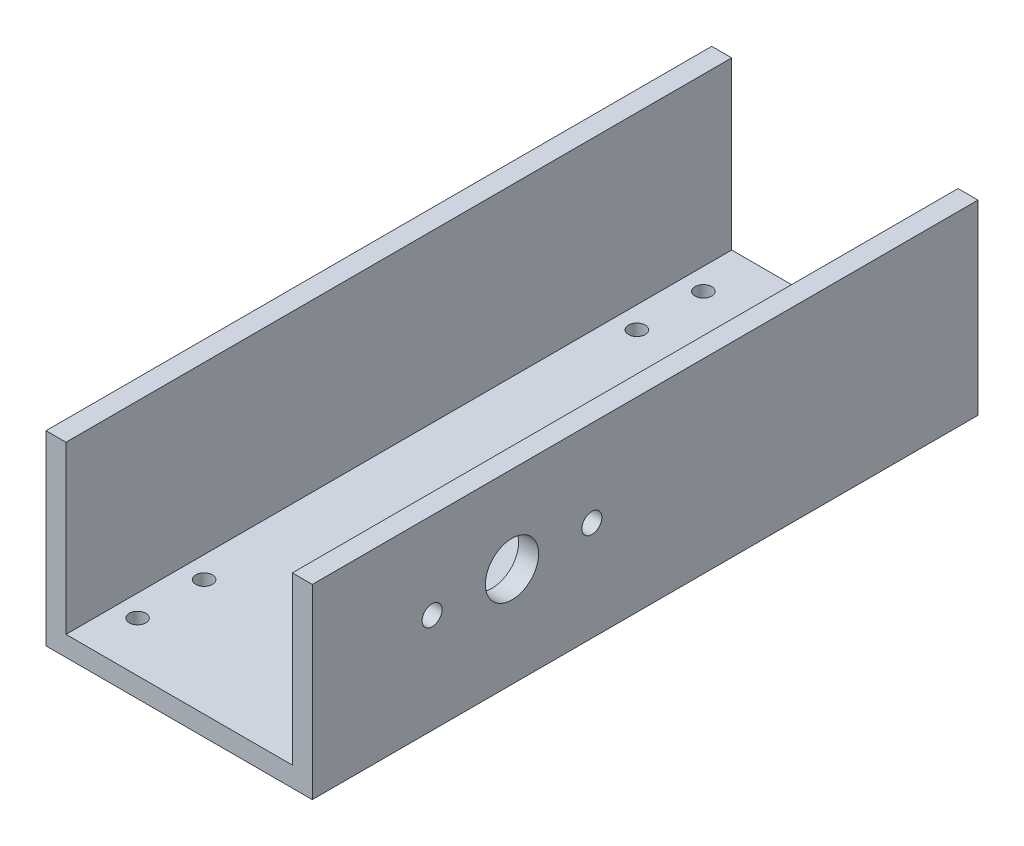
ISO-10303-21;
HEADER;
FILE_DESCRIPTION(('STEP AP214'),'2;1');
FILE_NAME('part.step','',(''),(''),'','','');
FILE_SCHEMA(('AUTOMOTIVE_DESIGN { 1 0 10303 214 1 1 1 1 }'));
ENDSEC;
DATA;
#1=APPLICATION_CONTEXT('core data for automotive mechanical design processes');
#2=APPLICATION_PROTOCOL_DEFINITION('international standard','automotive_design',2000,#1);
#3=PRODUCT_CONTEXT('',#1,'mechanical');
#4=PRODUCT('Part','Part','',(#3));
#5=PRODUCT_RELATED_PRODUCT_CATEGORY('part','',(#4));
#6=PRODUCT_DEFINITION_FORMATION('','',#4);
#7=PRODUCT_DEFINITION_CONTEXT('part definition',#1,'design');
#8=PRODUCT_DEFINITION('design','',#6,#7);
#9=PRODUCT_DEFINITION_SHAPE('','',#8);
#10=(LENGTH_UNIT() NAMED_UNIT(*) SI_UNIT(.MILLI.,.METRE.));
#11=(NAMED_UNIT(*) PLANE_ANGLE_UNIT() SI_UNIT($,.RADIAN.));
#12=(NAMED_UNIT(*) SI_UNIT($,.STERADIAN.) SOLID_ANGLE_UNIT());
#13=UNCERTAINTY_MEASURE_WITH_UNIT(LENGTH_MEASURE(1.E-05),#10,'distance_accuracy_value','');
#14=(GEOMETRIC_REPRESENTATION_CONTEXT(3) GLOBAL_UNCERTAINTY_ASSIGNED_CONTEXT((#13)) GLOBAL_UNIT_ASSIGNED_CONTEXT((#10,
#11,#12)) REPRESENTATION_CONTEXT('',''));
#15=CARTESIAN_POINT('',(0.,0.,0.));
#16=DIRECTION('',(0.,0.,1.));
#17=DIRECTION('',(1.,0.,0.));
#18=AXIS2_PLACEMENT_3D('',#15,#16,#17);
#19=CARTESIAN_POINT('',(34.,56.,200.));
#20=DIRECTION('',(1.,0.,0.));
#21=DIRECTION('',(0.,1.,0.));
#22=AXIS2_PLACEMENT_3D('',#19,#20,#21);
#23=PLANE('',#22);
#24=DIRECTION('',(0.,-1.,0.));
#25=VECTOR('',#24,1.);
#26=CARTESIAN_POINT('',(34.,56.,0.));
#27=LINE('',#26,#25);
#28=CARTESIAN_POINT('',(34.,56.,0.));
#29=VERTEX_POINT('',#28);
#30=CARTESIAN_POINT('',(34.,5.99999999999999,0.));
#31=VERTEX_POINT('',#30);
#32=EDGE_CURVE('E135',#29,#31,#27,.T.);
#33=ORIENTED_EDGE('',*,*,#32,.T.);
#34=DIRECTION('',(0.,0.,-1.));
#35=VECTOR('',#34,1.);
#36=CARTESIAN_POINT('',(34.,5.99999999999999,200.));
#37=LINE('',#36,#35);
#38=CARTESIAN_POINT('',(34.,5.99999999999999,200.));
#39=VERTEX_POINT('',#38);
#40=EDGE_CURVE('E44',#39,#31,#37,.T.);
#41=ORIENTED_EDGE('',*,*,#40,.F.);
#42=DIRECTION('',(0.,-1.,0.));
#43=VECTOR('',#42,1.);
#44=CARTESIAN_POINT('',(34.,56.,200.));
#45=LINE('',#44,#43);
#46=CARTESIAN_POINT('',(34.,56.,200.));
#47=VERTEX_POINT('',#46);
#48=EDGE_CURVE('E95',#47,#39,#45,.T.);
#49=ORIENTED_EDGE('',*,*,#48,.F.);
#50=DIRECTION('',(0.,0.,-1.));
#51=VECTOR('',#50,1.);
#52=CARTESIAN_POINT('',(34.,56.,200.));
#53=LINE('',#52,#51);
#54=EDGE_CURVE('E11',#47,#29,#53,.T.);
#55=ORIENTED_EDGE('',*,*,#54,.T.);
#56=EDGE_LOOP('',(#33,#41,#49,#55));
#57=FACE_BOUND('',#56,.T.);
#58=CARTESIAN_POINT('',(34.,30.,140.));
#59=DIRECTION('',(1.,0.,0.));
#60=DIRECTION('',(0.,1.,0.));
#61=AXIS2_PLACEMENT_3D('',#58,#59,#60);
#62=CIRCLE('',#61,8.00000000000001);
#63=CARTESIAN_POINT('',(34.,38.,140.));
#64=VERTEX_POINT('',#63);
#65=EDGE_CURVE('E136',#64,#64,#62,.F.);
#66=ORIENTED_EDGE('',*,*,#65,.F.);
#67=EDGE_LOOP('',(#66));
#68=FACE_BOUND('',#67,.T.);
#69=CARTESIAN_POINT('',(34.,30.,164.));
#70=DIRECTION('',(1.,0.,0.));
#71=DIRECTION('',(0.,1.,0.));
#72=AXIS2_PLACEMENT_3D('',#69,#70,#71);
#73=CIRCLE('',#72,2.99999999999999);
#74=CARTESIAN_POINT('',(34.,33.,164.));
#75=VERTEX_POINT('',#74);
#76=EDGE_CURVE('E183',#75,#75,#73,.F.);
#77=ORIENTED_EDGE('',*,*,#76,.F.);
#78=EDGE_LOOP('',(#77));
#79=FACE_BOUND('',#78,.T.);
#80=CARTESIAN_POINT('',(34.,30.,116.));
#81=DIRECTION('',(1.,0.,0.));
#82=DIRECTION('',(0.,1.,0.));
#83=AXIS2_PLACEMENT_3D('',#80,#81,#82);
#84=CIRCLE('',#83,3.00000000000001);
#85=CARTESIAN_POINT('',(34.,33.,116.));
#86=VERTEX_POINT('',#85);
#87=EDGE_CURVE('E189',#86,#86,#84,.T.);
#88=ORIENTED_EDGE('',*,*,#87,.T.);
#89=EDGE_LOOP('',(#88));
#90=FACE_BOUND('',#89,.T.);
#91=ADVANCED_FACE('F35',(#57,#68,#79,#90),#23,.F.);
#92=CARTESIAN_POINT('',(40.,0.,200.));
#93=DIRECTION('',(-1.,0.,0.));
#94=DIRECTION('',(0.,0.,1.));
#95=AXIS2_PLACEMENT_3D('',#92,#93,#94);
#96=PLANE('',#95);
#97=DIRECTION('',(0.,1.,0.));
#98=VECTOR('',#97,1.);
#99=CARTESIAN_POINT('',(40.,0.,0.));
#100=LINE('',#99,#98);
#101=CARTESIAN_POINT('',(40.,0.,0.));
#102=VERTEX_POINT('',#101);
#103=CARTESIAN_POINT('',(40.,56.,0.));
#104=VERTEX_POINT('',#103);
#105=EDGE_CURVE('E87',#102,#104,#100,.T.);
#106=ORIENTED_EDGE('',*,*,#105,.T.);
#107=DIRECTION('',(0.,0.,-1.));
#108=VECTOR('',#107,1.);
#109=CARTESIAN_POINT('',(40.,56.,200.));
#110=LINE('',#109,#108);
#111=CARTESIAN_POINT('',(40.,56.,200.));
#112=VERTEX_POINT('',#111);
#113=EDGE_CURVE('E128',#112,#104,#110,.T.);
#114=ORIENTED_EDGE('',*,*,#113,.F.);
#115=DIRECTION('',(0.,1.,0.));
#116=VECTOR('',#115,1.);
#117=CARTESIAN_POINT('',(40.,0.,200.));
#118=LINE('',#117,#116);
#119=CARTESIAN_POINT('',(40.,0.,200.));
#120=VERTEX_POINT('',#119);
#121=EDGE_CURVE('E52',#120,#112,#118,.T.);
#122=ORIENTED_EDGE('',*,*,#121,.F.);
#123=DIRECTION('',(0.,0.,-1.));
#124=VECTOR('',#123,1.);
#125=CARTESIAN_POINT('',(40.,0.,200.));
#126=LINE('',#125,#124);
#127=EDGE_CURVE('E124',#120,#102,#126,.T.);
#128=ORIENTED_EDGE('',*,*,#127,.T.);
#129=EDGE_LOOP('',(#106,#114,#122,#128));
#130=FACE_BOUND('',#129,.T.);
#131=CARTESIAN_POINT('',(40.,30.,140.));
#132=DIRECTION('',(1.,0.,0.));
#133=DIRECTION('',(0.,0.,-1.));
#134=AXIS2_PLACEMENT_3D('',#131,#132,#133);
#135=CIRCLE('',#134,8.00000000000001);
#136=CARTESIAN_POINT('',(40.,30.,132.));
#137=VERTEX_POINT('',#136);
#138=EDGE_CURVE('E180',#137,#137,#135,.T.);
#139=ORIENTED_EDGE('',*,*,#138,.F.);
#140=EDGE_LOOP('',(#139));
#141=FACE_BOUND('',#140,.T.);
#142=CARTESIAN_POINT('',(40.,30.,164.));
#143=DIRECTION('',(1.,0.,0.));
#144=DIRECTION('',(0.,0.,-1.));
#145=AXIS2_PLACEMENT_3D('',#142,#143,#144);
#146=CIRCLE('',#145,2.99999999999999);
#147=CARTESIAN_POINT('',(40.,30.,161.));
#148=VERTEX_POINT('',#147);
#149=EDGE_CURVE('E186',#148,#148,#146,.T.);
#150=ORIENTED_EDGE('',*,*,#149,.F.);
#151=EDGE_LOOP('',(#150));
#152=FACE_BOUND('',#151,.T.);
#153=CARTESIAN_POINT('',(40.,30.,116.));
#154=DIRECTION('',(1.,0.,0.));
#155=DIRECTION('',(0.,0.,-1.));
#156=AXIS2_PLACEMENT_3D('',#153,#154,#155);
#157=CIRCLE('',#156,3.00000000000001);
#158=CARTESIAN_POINT('',(40.,30.,113.));
#159=VERTEX_POINT('',#158);
#160=EDGE_CURVE('E192',#159,#159,#157,.F.);
#161=ORIENTED_EDGE('',*,*,#160,.T.);
#162=EDGE_LOOP('',(#161));
#163=FACE_BOUND('',#162,.T.);
#164=ADVANCED_FACE('F282',(#130,#141,#152,#163),#96,.F.);
#165=CARTESIAN_POINT('',(40.,56.,200.));
#166=DIRECTION('',(0.,-1.,0.));
#167=DIRECTION('',(0.,0.,-1.));
#168=AXIS2_PLACEMENT_3D('',#165,#166,#167);
#169=PLANE('',#168);
#170=DIRECTION('',(-1.,0.,0.));
#171=VECTOR('',#170,1.);
#172=CARTESIAN_POINT('',(40.,56.,0.));
#173=LINE('',#172,#171);
#174=EDGE_CURVE('E132',#104,#29,#173,.T.);
#175=ORIENTED_EDGE('',*,*,#174,.T.);
#176=ORIENTED_EDGE('',*,*,#54,.F.);
#177=DIRECTION('',(-1.,0.,0.));
#178=VECTOR('',#177,1.);
#179=CARTESIAN_POINT('',(40.,56.,200.));
#180=LINE('',#179,#178);
#181=EDGE_CURVE('E147',#112,#47,#180,.T.);
#182=ORIENTED_EDGE('',*,*,#181,.F.);
#183=ORIENTED_EDGE('',*,*,#113,.T.);
#184=EDGE_LOOP('',(#175,#176,#182,#183));
#185=FACE_BOUND('',#184,.T.);
#186=ADVANCED_FACE('F37',(#185),#169,.F.);
#187=CARTESIAN_POINT('',(34.,5.99999999999999,200.));
#188=DIRECTION('',(0.,-1.,0.));
#189=DIRECTION('',(0.,0.,-1.));
#190=AXIS2_PLACEMENT_3D('',#187,#188,#189);
#191=PLANE('',#190);
#192=CARTESIAN_POINT('',(-27.5,5.99999999999999,15.));
#193=DIRECTION('',(0.,-1.,0.));
#194=DIRECTION('',(0.,0.,-1.));
#195=AXIS2_PLACEMENT_3D('',#192,#193,#194);
#196=CIRCLE('',#195,2.49999999999999);
#197=CARTESIAN_POINT('',(-27.5,5.99999999999999,12.5));
#198=VERTEX_POINT('',#197);
#199=EDGE_CURVE('E239',#198,#198,#196,.F.);
#200=ORIENTED_EDGE('',*,*,#199,.F.);
#201=EDGE_LOOP('',(#200));
#202=FACE_BOUND('',#201,.T.);
#203=CARTESIAN_POINT('',(27.5,5.99999999999999,15.));
#204=DIRECTION('',(0.,-1.,0.));
#205=DIRECTION('',(0.,0.,-1.));
#206=AXIS2_PLACEMENT_3D('',#203,#204,#205);
#207=CIRCLE('',#206,2.49999999999999);
#208=CARTESIAN_POINT('',(27.5,5.99999999999999,12.5));
#209=VERTEX_POINT('',#208);
#210=EDGE_CURVE('E233',#209,#209,#207,.F.);
#211=ORIENTED_EDGE('',*,*,#210,.F.);
#212=EDGE_LOOP('',(#211));
#213=FACE_BOUND('',#212,.T.);
#214=CARTESIAN_POINT('',(-27.5,5.99999999999999,35.));
#215=DIRECTION('',(0.,-1.,0.));
#216=DIRECTION('',(0.,0.,-1.));
#217=AXIS2_PLACEMENT_3D('',#214,#215,#216);
#218=CIRCLE('',#217,2.50000000000001);
#219=CARTESIAN_POINT('',(-27.5,5.99999999999999,32.5));
#220=VERTEX_POINT('',#219);
#221=EDGE_CURVE('E227',#220,#220,#218,.F.);
#222=ORIENTED_EDGE('',*,*,#221,.F.);
#223=EDGE_LOOP('',(#222));
#224=FACE_BOUND('',#223,.T.);
#225=CARTESIAN_POINT('',(27.5,5.99999999999999,35.));
#226=DIRECTION('',(0.,-1.,0.));
#227=DIRECTION('',(0.,0.,-1.));
#228=AXIS2_PLACEMENT_3D('',#225,#226,#227);
#229=CIRCLE('',#228,2.50000000000001);
#230=CARTESIAN_POINT('',(27.5,5.99999999999999,32.5));
#231=VERTEX_POINT('',#230);
#232=EDGE_CURVE('E221',#231,#231,#229,.F.);
#233=ORIENTED_EDGE('',*,*,#232,.F.);
#234=EDGE_LOOP('',(#233));
#235=FACE_BOUND('',#234,.T.);
#236=CARTESIAN_POINT('',(27.5,5.99999999999999,165.));
#237=DIRECTION('',(0.,-1.,0.));
#238=DIRECTION('',(0.,0.,-1.));
#239=AXIS2_PLACEMENT_3D('',#236,#237,#238);
#240=CIRCLE('',#239,2.50000000000001);
#241=CARTESIAN_POINT('',(27.5,5.99999999999999,162.5));
#242=VERTEX_POINT('',#241);
#243=EDGE_CURVE('E215',#242,#242,#240,.F.);
#244=ORIENTED_EDGE('',*,*,#243,.F.);
#245=EDGE_LOOP('',(#244));
#246=FACE_BOUND('',#245,.T.);
#247=CARTESIAN_POINT('',(-27.5,5.99999999999999,165.));
#248=DIRECTION('',(0.,-1.,0.));
#249=DIRECTION('',(0.,0.,-1.));
#250=AXIS2_PLACEMENT_3D('',#247,#248,#249);
#251=CIRCLE('',#250,2.50000000000001);
#252=CARTESIAN_POINT('',(-27.5,5.99999999999999,162.5));
#253=VERTEX_POINT('',#252);
#254=EDGE_CURVE('E209',#253,#253,#251,.F.);
#255=ORIENTED_EDGE('',*,*,#254,.F.);
#256=EDGE_LOOP('',(#255));
#257=FACE_BOUND('',#256,.T.);
#258=CARTESIAN_POINT('',(27.5,5.99999999999999,185.));
#259=DIRECTION('',(0.,-1.,0.));
#260=DIRECTION('',(0.,0.,-1.));
#261=AXIS2_PLACEMENT_3D('',#258,#259,#260);
#262=CIRCLE('',#261,2.5);
#263=CARTESIAN_POINT('',(27.5,5.99999999999999,182.5));
#264=VERTEX_POINT('',#263);
#265=EDGE_CURVE('E203',#264,#264,#262,.F.);
#266=ORIENTED_EDGE('',*,*,#265,.F.);
#267=EDGE_LOOP('',(#266));
#268=FACE_BOUND('',#267,.T.);
#269=CARTESIAN_POINT('',(-27.5,5.99999999999999,185.));
#270=DIRECTION('',(0.,-1.,0.));
#271=DIRECTION('',(0.,0.,-1.));
#272=AXIS2_PLACEMENT_3D('',#269,#270,#271);
#273=CIRCLE('',#272,2.5);
#274=CARTESIAN_POINT('',(-27.5,5.99999999999999,182.5));
#275=VERTEX_POINT('',#274);
#276=EDGE_CURVE('E195',#275,#275,#273,.F.);
#277=ORIENTED_EDGE('',*,*,#276,.F.);
#278=EDGE_LOOP('',(#277));
#279=FACE_BOUND('',#278,.T.);
#280=DIRECTION('',(-1.,0.,0.));
#281=VECTOR('',#280,1.);
#282=CARTESIAN_POINT('',(34.,5.99999999999999,0.));
#283=LINE('',#282,#281);
#284=CARTESIAN_POINT('',(-34.,5.99999999999999,0.));
#285=VERTEX_POINT('',#284);
#286=EDGE_CURVE('E138',#31,#285,#283,.T.);
#287=ORIENTED_EDGE('',*,*,#286,.T.);
#288=DIRECTION('',(0.,0.,-1.));
#289=VECTOR('',#288,1.);
#290=CARTESIAN_POINT('',(-34.,5.99999999999999,200.));
#291=LINE('',#290,#289);
#292=CARTESIAN_POINT('',(-34.,5.99999999999999,200.));
#293=VERTEX_POINT('',#292);
#294=EDGE_CURVE('E154',#293,#285,#291,.T.);
#295=ORIENTED_EDGE('',*,*,#294,.F.);
#296=DIRECTION('',(-1.,0.,0.));
#297=VECTOR('',#296,1.);
#298=CARTESIAN_POINT('',(34.,5.99999999999999,200.));
#299=LINE('',#298,#297);
#300=EDGE_CURVE('E162',#39,#293,#299,.T.);
#301=ORIENTED_EDGE('',*,*,#300,.F.);
#302=ORIENTED_EDGE('',*,*,#40,.T.);
#303=EDGE_LOOP('',(#287,#295,#301,#302));
#304=FACE_BOUND('',#303,.T.);
#305=ADVANCED_FACE('F160',(#202,#213,#224,#235,#246,#257,#268,#279,#304),#191,.F.);
#306=CARTESIAN_POINT('',(-34.,56.,200.));
#307=DIRECTION('',(-1.,0.,0.));
#308=DIRECTION('',(0.,-1.,0.));
#309=AXIS2_PLACEMENT_3D('',#306,#307,#308);
#310=PLANE('',#309);
#311=DIRECTION('',(0.,1.,0.));
#312=VECTOR('',#311,1.);
#313=CARTESIAN_POINT('',(-34.,56.,0.));
#314=LINE('',#313,#312);
#315=CARTESIAN_POINT('',(-34.,56.,0.));
#316=VERTEX_POINT('',#315);
#317=EDGE_CURVE('E140',#285,#316,#314,.T.);
#318=ORIENTED_EDGE('',*,*,#317,.T.);
#319=DIRECTION('',(0.,0.,-1.));
#320=VECTOR('',#319,1.);
#321=CARTESIAN_POINT('',(-34.,56.,200.));
#322=LINE('',#321,#320);
#323=CARTESIAN_POINT('',(-34.,56.,200.));
#324=VERTEX_POINT('',#323);
#325=EDGE_CURVE('E151',#324,#316,#322,.T.);
#326=ORIENTED_EDGE('',*,*,#325,.F.);
#327=DIRECTION('',(0.,1.,0.));
#328=VECTOR('',#327,1.);
#329=CARTESIAN_POINT('',(-34.,56.,200.));
#330=LINE('',#329,#328);
#331=EDGE_CURVE('E174',#293,#324,#330,.T.);
#332=ORIENTED_EDGE('',*,*,#331,.F.);
#333=ORIENTED_EDGE('',*,*,#294,.T.);
#334=EDGE_LOOP('',(#318,#326,#332,#333));
#335=FACE_BOUND('',#334,.T.);
#336=ADVANCED_FACE('F170',(#335),#310,.F.);
#337=CARTESIAN_POINT('',(-40.,56.,200.));
#338=DIRECTION('',(0.,-1.,0.));
#339=DIRECTION('',(0.,0.,-1.));
#340=AXIS2_PLACEMENT_3D('',#337,#338,#339);
#341=PLANE('',#340);
#342=DIRECTION('',(-1.,0.,0.));
#343=VECTOR('',#342,1.);
#344=CARTESIAN_POINT('',(-40.,56.,0.));
#345=LINE('',#344,#343);
#346=CARTESIAN_POINT('',(-40.,56.,0.));
#347=VERTEX_POINT('',#346);
#348=EDGE_CURVE('E142',#316,#347,#345,.T.);
#349=ORIENTED_EDGE('',*,*,#348,.T.);
#350=DIRECTION('',(0.,0.,-1.));
#351=VECTOR('',#350,1.);
#352=CARTESIAN_POINT('',(-40.,56.,200.));
#353=LINE('',#352,#351);
#354=CARTESIAN_POINT('',(-40.,56.,200.));
#355=VERTEX_POINT('',#354);
#356=EDGE_CURVE('E123',#355,#347,#353,.T.);
#357=ORIENTED_EDGE('',*,*,#356,.F.);
#358=DIRECTION('',(-1.,0.,0.));
#359=VECTOR('',#358,1.);
#360=CARTESIAN_POINT('',(-40.,56.,200.));
#361=LINE('',#360,#359);
#362=EDGE_CURVE('E114',#324,#355,#361,.T.);
#363=ORIENTED_EDGE('',*,*,#362,.F.);
#364=ORIENTED_EDGE('',*,*,#325,.T.);
#365=EDGE_LOOP('',(#349,#357,#363,#364));
#366=FACE_BOUND('',#365,.T.);
#367=ADVANCED_FACE('F173',(#366),#341,.F.);
#368=CARTESIAN_POINT('',(-40.,0.,200.));
#369=DIRECTION('',(1.,0.,0.));
#370=DIRECTION('',(0.,0.,-1.));
#371=AXIS2_PLACEMENT_3D('',#368,#369,#370);
#372=PLANE('',#371);
#373=DIRECTION('',(0.,-1.,0.));
#374=VECTOR('',#373,1.);
#375=CARTESIAN_POINT('',(-40.,0.,0.));
#376=LINE('',#375,#374);
#377=CARTESIAN_POINT('',(-40.,0.,0.));
#378=VERTEX_POINT('',#377);
#379=EDGE_CURVE('E122',#347,#378,#376,.T.);
#380=ORIENTED_EDGE('',*,*,#379,.T.);
#381=DIRECTION('',(0.,0.,-1.));
#382=VECTOR('',#381,1.);
#383=CARTESIAN_POINT('',(-40.,0.,200.));
#384=LINE('',#383,#382);
#385=CARTESIAN_POINT('',(-40.,0.,200.));
#386=VERTEX_POINT('',#385);
#387=EDGE_CURVE('E119',#386,#378,#384,.T.);
#388=ORIENTED_EDGE('',*,*,#387,.F.);
#389=DIRECTION('',(0.,-1.,0.));
#390=VECTOR('',#389,1.);
#391=CARTESIAN_POINT('',(-40.,0.,200.));
#392=LINE('',#391,#390);
#393=EDGE_CURVE('E108',#355,#386,#392,.T.);
#394=ORIENTED_EDGE('',*,*,#393,.F.);
#395=ORIENTED_EDGE('',*,*,#356,.T.);
#396=EDGE_LOOP('',(#380,#388,#394,#395));
#397=FACE_BOUND('',#396,.T.);
#398=ADVANCED_FACE('F120',(#397),#372,.F.);
#399=CARTESIAN_POINT('',(-40.,0.,200.));
#400=DIRECTION('',(0.,1.,0.));
#401=DIRECTION('',(0.,0.,1.));
#402=AXIS2_PLACEMENT_3D('',#399,#400,#401);
#403=PLANE('',#402);
#404=CARTESIAN_POINT('',(-27.5,0.,15.));
#405=DIRECTION('',(0.,-1.,0.));
#406=DIRECTION('',(0.,0.,1.));
#407=AXIS2_PLACEMENT_3D('',#404,#405,#406);
#408=CIRCLE('',#407,2.49999999999999);
#409=CARTESIAN_POINT('',(-27.5,0.,17.5));
#410=VERTEX_POINT('',#409);
#411=EDGE_CURVE('E242',#410,#410,#408,.T.);
#412=ORIENTED_EDGE('',*,*,#411,.F.);
#413=EDGE_LOOP('',(#412));
#414=FACE_BOUND('',#413,.T.);
#415=CARTESIAN_POINT('',(27.5,0.,15.));
#416=DIRECTION('',(0.,-1.,0.));
#417=DIRECTION('',(0.,0.,1.));
#418=AXIS2_PLACEMENT_3D('',#415,#416,#417);
#419=CIRCLE('',#418,2.49999999999999);
#420=CARTESIAN_POINT('',(27.5,0.,17.5));
#421=VERTEX_POINT('',#420);
#422=EDGE_CURVE('E236',#421,#421,#419,.T.);
#423=ORIENTED_EDGE('',*,*,#422,.F.);
#424=EDGE_LOOP('',(#423));
#425=FACE_BOUND('',#424,.T.);
#426=CARTESIAN_POINT('',(-27.5,0.,35.));
#427=DIRECTION('',(0.,-1.,0.));
#428=DIRECTION('',(0.,0.,1.));
#429=AXIS2_PLACEMENT_3D('',#426,#427,#428);
#430=CIRCLE('',#429,2.50000000000001);
#431=CARTESIAN_POINT('',(-27.5,0.,37.5));
#432=VERTEX_POINT('',#431);
#433=EDGE_CURVE('E230',#432,#432,#430,.T.);
#434=ORIENTED_EDGE('',*,*,#433,.F.);
#435=EDGE_LOOP('',(#434));
#436=FACE_BOUND('',#435,.T.);
#437=CARTESIAN_POINT('',(27.5,0.,35.));
#438=DIRECTION('',(0.,-1.,0.));
#439=DIRECTION('',(0.,0.,1.));
#440=AXIS2_PLACEMENT_3D('',#437,#438,#439);
#441=CIRCLE('',#440,2.50000000000001);
#442=CARTESIAN_POINT('',(27.5,0.,37.5));
#443=VERTEX_POINT('',#442);
#444=EDGE_CURVE('E224',#443,#443,#441,.T.);
#445=ORIENTED_EDGE('',*,*,#444,.F.);
#446=EDGE_LOOP('',(#445));
#447=FACE_BOUND('',#446,.T.);
#448=CARTESIAN_POINT('',(27.5,0.,165.));
#449=DIRECTION('',(0.,-1.,0.));
#450=DIRECTION('',(0.,0.,-1.));
#451=AXIS2_PLACEMENT_3D('',#448,#449,#450);
#452=CIRCLE('',#451,2.50000000000001);
#453=CARTESIAN_POINT('',(27.5,0.,162.5));
#454=VERTEX_POINT('',#453);
#455=EDGE_CURVE('E218',#454,#454,#452,.T.);
#456=ORIENTED_EDGE('',*,*,#455,.F.);
#457=EDGE_LOOP('',(#456));
#458=FACE_BOUND('',#457,.T.);
#459=CARTESIAN_POINT('',(-27.5,0.,165.));
#460=DIRECTION('',(0.,-1.,0.));
#461=DIRECTION('',(0.,0.,-1.));
#462=AXIS2_PLACEMENT_3D('',#459,#460,#461);
#463=CIRCLE('',#462,2.50000000000001);
#464=CARTESIAN_POINT('',(-27.5,0.,162.5));
#465=VERTEX_POINT('',#464);
#466=EDGE_CURVE('E212',#465,#465,#463,.T.);
#467=ORIENTED_EDGE('',*,*,#466,.F.);
#468=EDGE_LOOP('',(#467));
#469=FACE_BOUND('',#468,.T.);
#470=CARTESIAN_POINT('',(27.5,0.,185.));
#471=DIRECTION('',(0.,-1.,0.));
#472=DIRECTION('',(0.,0.,-1.));
#473=AXIS2_PLACEMENT_3D('',#470,#471,#472);
#474=CIRCLE('',#473,2.5);
#475=CARTESIAN_POINT('',(27.5,0.,182.5));
#476=VERTEX_POINT('',#475);
#477=EDGE_CURVE('E206',#476,#476,#474,.T.);
#478=ORIENTED_EDGE('',*,*,#477,.F.);
#479=EDGE_LOOP('',(#478));
#480=FACE_BOUND('',#479,.T.);
#481=CARTESIAN_POINT('',(-27.5,0.,185.));
#482=DIRECTION('',(0.,-1.,0.));
#483=DIRECTION('',(0.,0.,-1.));
#484=AXIS2_PLACEMENT_3D('',#481,#482,#483);
#485=CIRCLE('',#484,2.5);
#486=CARTESIAN_POINT('',(-27.5,0.,182.5));
#487=VERTEX_POINT('',#486);
#488=EDGE_CURVE('E200',#487,#487,#485,.T.);
#489=ORIENTED_EDGE('',*,*,#488,.F.);
#490=EDGE_LOOP('',(#489));
#491=FACE_BOUND('',#490,.T.);
#492=DIRECTION('',(1.,0.,0.));
#493=VECTOR('',#492,1.);
#494=CARTESIAN_POINT('',(-40.,0.,0.));
#495=LINE('',#494,#493);
#496=EDGE_CURVE('E81',#378,#102,#495,.T.);
#497=ORIENTED_EDGE('',*,*,#496,.T.);
#498=ORIENTED_EDGE('',*,*,#127,.F.);
#499=DIRECTION('',(1.,0.,0.));
#500=VECTOR('',#499,1.);
#501=CARTESIAN_POINT('',(-40.,0.,200.));
#502=LINE('',#501,#500);
#503=EDGE_CURVE('E112',#386,#120,#502,.T.);
#504=ORIENTED_EDGE('',*,*,#503,.F.);
#505=ORIENTED_EDGE('',*,*,#387,.T.);
#506=EDGE_LOOP('',(#497,#498,#504,#505));
#507=FACE_BOUND('',#506,.T.);
#508=ADVANCED_FACE('F126',(#414,#425,#436,#447,#458,#469,#480,#491,#507),#403,.F.);
#509=CARTESIAN_POINT('',(0.,0.,200.));
#510=DIRECTION('',(0.,0.,1.));
#511=DIRECTION('',(1.,0.,0.));
#512=AXIS2_PLACEMENT_3D('',#509,#510,#511);
#513=PLANE('',#512);
#514=ORIENTED_EDGE('',*,*,#181,.T.);
#515=ORIENTED_EDGE('',*,*,#48,.T.);
#516=ORIENTED_EDGE('',*,*,#300,.T.);
#517=ORIENTED_EDGE('',*,*,#331,.T.);
#518=ORIENTED_EDGE('',*,*,#362,.T.);
#519=ORIENTED_EDGE('',*,*,#393,.T.);
#520=ORIENTED_EDGE('',*,*,#503,.T.);
#521=ORIENTED_EDGE('',*,*,#121,.T.);
#522=EDGE_LOOP('',(#514,#515,#516,#517,#518,#519,#520,#521));
#523=FACE_BOUND('',#522,.T.);
#524=ADVANCED_FACE('F110',(#523),#513,.T.);
#525=CARTESIAN_POINT('',(0.,0.,0.));
#526=DIRECTION('',(0.,0.,1.));
#527=DIRECTION('',(1.,0.,0.));
#528=AXIS2_PLACEMENT_3D('',#525,#526,#527);
#529=PLANE('',#528);
#530=ORIENTED_EDGE('',*,*,#174,.F.);
#531=ORIENTED_EDGE('',*,*,#105,.F.);
#532=ORIENTED_EDGE('',*,*,#496,.F.);
#533=ORIENTED_EDGE('',*,*,#379,.F.);
#534=ORIENTED_EDGE('',*,*,#348,.F.);
#535=ORIENTED_EDGE('',*,*,#317,.F.);
#536=ORIENTED_EDGE('',*,*,#286,.F.);
#537=ORIENTED_EDGE('',*,*,#32,.F.);
#538=EDGE_LOOP('',(#530,#531,#532,#533,#534,#535,#536,#537));
#539=FACE_BOUND('',#538,.T.);
#540=ADVANCED_FACE('F166',(#539),#529,.F.);
#541=CARTESIAN_POINT('',(-40.001,30.,140.));
#542=DIRECTION('',(1.,0.,0.));
#543=DIRECTION('',(0.,0.,-1.));
#544=AXIS2_PLACEMENT_3D('',#541,#542,#543);
#545=CYLINDRICAL_SURFACE('',#544,8.00000000000001);
#546=ORIENTED_EDGE('',*,*,#138,.T.);
#547=EDGE_LOOP('',(#546));
#548=FACE_BOUND('',#547,.T.);
#549=ORIENTED_EDGE('',*,*,#65,.T.);
#550=EDGE_LOOP('',(#549));
#551=FACE_BOUND('',#550,.T.);
#552=ADVANCED_FACE('F305',(#548,#551),#545,.F.);
#553=CARTESIAN_POINT('',(-40.001,30.,164.));
#554=DIRECTION('',(1.,0.,0.));
#555=DIRECTION('',(0.,0.,-1.));
#556=AXIS2_PLACEMENT_3D('',#553,#554,#555);
#557=CYLINDRICAL_SURFACE('',#556,2.99999999999999);
#558=ORIENTED_EDGE('',*,*,#149,.T.);
#559=EDGE_LOOP('',(#558));
#560=FACE_BOUND('',#559,.T.);
#561=ORIENTED_EDGE('',*,*,#76,.T.);
#562=EDGE_LOOP('',(#561));
#563=FACE_BOUND('',#562,.T.);
#564=ADVANCED_FACE('F299',(#560,#563),#557,.F.);
#565=CARTESIAN_POINT('',(-40.001,30.,116.));
#566=DIRECTION('',(1.,0.,0.));
#567=DIRECTION('',(0.,0.,-1.));
#568=AXIS2_PLACEMENT_3D('',#565,#566,#567);
#569=CYLINDRICAL_SURFACE('',#568,3.00000000000001);
#570=ORIENTED_EDGE('',*,*,#160,.F.);
#571=EDGE_LOOP('',(#570));
#572=FACE_BOUND('',#571,.T.);
#573=ORIENTED_EDGE('',*,*,#87,.F.);
#574=EDGE_LOOP('',(#573));
#575=FACE_BOUND('',#574,.T.);
#576=ADVANCED_FACE('F270',(#572,#575),#569,.F.);
#577=CARTESIAN_POINT('',(-27.5,56.001,185.));
#578=DIRECTION('',(0.,-1.,0.));
#579=DIRECTION('',(0.,0.,-1.));
#580=AXIS2_PLACEMENT_3D('',#577,#578,#579);
#581=CYLINDRICAL_SURFACE('',#580,2.5);
#582=ORIENTED_EDGE('',*,*,#488,.T.);
#583=EDGE_LOOP('',(#582));
#584=FACE_BOUND('',#583,.T.);
#585=ORIENTED_EDGE('',*,*,#276,.T.);
#586=EDGE_LOOP('',(#585));
#587=FACE_BOUND('',#586,.T.);
#588=ADVANCED_FACE('F266',(#584,#587),#581,.F.);
#589=CARTESIAN_POINT('',(27.5,56.001,185.));
#590=DIRECTION('',(0.,-1.,0.));
#591=DIRECTION('',(0.,0.,-1.));
#592=AXIS2_PLACEMENT_3D('',#589,#590,#591);
#593=CYLINDRICAL_SURFACE('',#592,2.5);
#594=ORIENTED_EDGE('',*,*,#477,.T.);
#595=EDGE_LOOP('',(#594));
#596=FACE_BOUND('',#595,.T.);
#597=ORIENTED_EDGE('',*,*,#265,.T.);
#598=EDGE_LOOP('',(#597));
#599=FACE_BOUND('',#598,.T.);
#600=ADVANCED_FACE('F269',(#596,#599),#593,.F.);
#601=CARTESIAN_POINT('',(-27.5,56.001,165.));
#602=DIRECTION('',(0.,-1.,0.));
#603=DIRECTION('',(0.,0.,-1.));
#604=AXIS2_PLACEMENT_3D('',#601,#602,#603);
#605=CYLINDRICAL_SURFACE('',#604,2.50000000000001);
#606=ORIENTED_EDGE('',*,*,#466,.T.);
#607=EDGE_LOOP('',(#606));
#608=FACE_BOUND('',#607,.T.);
#609=ORIENTED_EDGE('',*,*,#254,.T.);
#610=EDGE_LOOP('',(#609));
#611=FACE_BOUND('',#610,.T.);
#612=ADVANCED_FACE('F404',(#608,#611),#605,.F.);
#613=CARTESIAN_POINT('',(27.5,56.001,165.));
#614=DIRECTION('',(0.,-1.,0.));
#615=DIRECTION('',(0.,0.,-1.));
#616=AXIS2_PLACEMENT_3D('',#613,#614,#615);
#617=CYLINDRICAL_SURFACE('',#616,2.50000000000001);
#618=ORIENTED_EDGE('',*,*,#455,.T.);
#619=EDGE_LOOP('',(#618));
#620=FACE_BOUND('',#619,.T.);
#621=ORIENTED_EDGE('',*,*,#243,.T.);
#622=EDGE_LOOP('',(#621));
#623=FACE_BOUND('',#622,.T.);
#624=ADVANCED_FACE('F412',(#620,#623),#617,.F.);
#625=CARTESIAN_POINT('',(27.5,56.001,35.));
#626=DIRECTION('',(0.,-1.,0.));
#627=DIRECTION('',(0.,0.,-1.));
#628=AXIS2_PLACEMENT_3D('',#625,#626,#627);
#629=CYLINDRICAL_SURFACE('',#628,2.50000000000001);
#630=ORIENTED_EDGE('',*,*,#444,.T.);
#631=EDGE_LOOP('',(#630));
#632=FACE_BOUND('',#631,.T.);
#633=ORIENTED_EDGE('',*,*,#232,.T.);
#634=EDGE_LOOP('',(#633));
#635=FACE_BOUND('',#634,.T.);
#636=ADVANCED_FACE('F421',(#632,#635),#629,.F.);
#637=CARTESIAN_POINT('',(-27.5,56.001,35.));
#638=DIRECTION('',(0.,-1.,0.));
#639=DIRECTION('',(0.,0.,-1.));
#640=AXIS2_PLACEMENT_3D('',#637,#638,#639);
#641=CYLINDRICAL_SURFACE('',#640,2.50000000000001);
#642=ORIENTED_EDGE('',*,*,#433,.T.);
#643=EDGE_LOOP('',(#642));
#644=FACE_BOUND('',#643,.T.);
#645=ORIENTED_EDGE('',*,*,#221,.T.);
#646=EDGE_LOOP('',(#645));
#647=FACE_BOUND('',#646,.T.);
#648=ADVANCED_FACE('F430',(#644,#647),#641,.F.);
#649=CARTESIAN_POINT('',(27.5,56.001,15.));
#650=DIRECTION('',(0.,-1.,0.));
#651=DIRECTION('',(0.,0.,-1.));
#652=AXIS2_PLACEMENT_3D('',#649,#650,#651);
#653=CYLINDRICAL_SURFACE('',#652,2.49999999999999);
#654=ORIENTED_EDGE('',*,*,#422,.T.);
#655=EDGE_LOOP('',(#654));
#656=FACE_BOUND('',#655,.T.);
#657=ORIENTED_EDGE('',*,*,#210,.T.);
#658=EDGE_LOOP('',(#657));
#659=FACE_BOUND('',#658,.T.);
#660=ADVANCED_FACE('F439',(#656,#659),#653,.F.);
#661=CARTESIAN_POINT('',(-27.5,56.001,15.));
#662=DIRECTION('',(0.,-1.,0.));
#663=DIRECTION('',(0.,0.,-1.));
#664=AXIS2_PLACEMENT_3D('',#661,#662,#663);
#665=CYLINDRICAL_SURFACE('',#664,2.49999999999999);
#666=ORIENTED_EDGE('',*,*,#411,.T.);
#667=EDGE_LOOP('',(#666));
#668=FACE_BOUND('',#667,.T.);
#669=ORIENTED_EDGE('',*,*,#199,.T.);
#670=EDGE_LOOP('',(#669));
#671=FACE_BOUND('',#670,.T.);
#672=ADVANCED_FACE('F246',(#668,#671),#665,.F.);
#673=CLOSED_SHELL('',(#91,#164,#186,#305,#336,#367,#398,#508,#524,#540,#552,#564,#576,#588,#600,
#612,#624,#636,#648,#660,#672));
#674=MANIFOLD_SOLID_BREP('B2',#673);
#675=ADVANCED_BREP_SHAPE_REPRESENTATION('',(#18,#674),#14);
#676=SHAPE_DEFINITION_REPRESENTATION(#9,#675);
ENDSEC;
END-ISO-10303-21;
